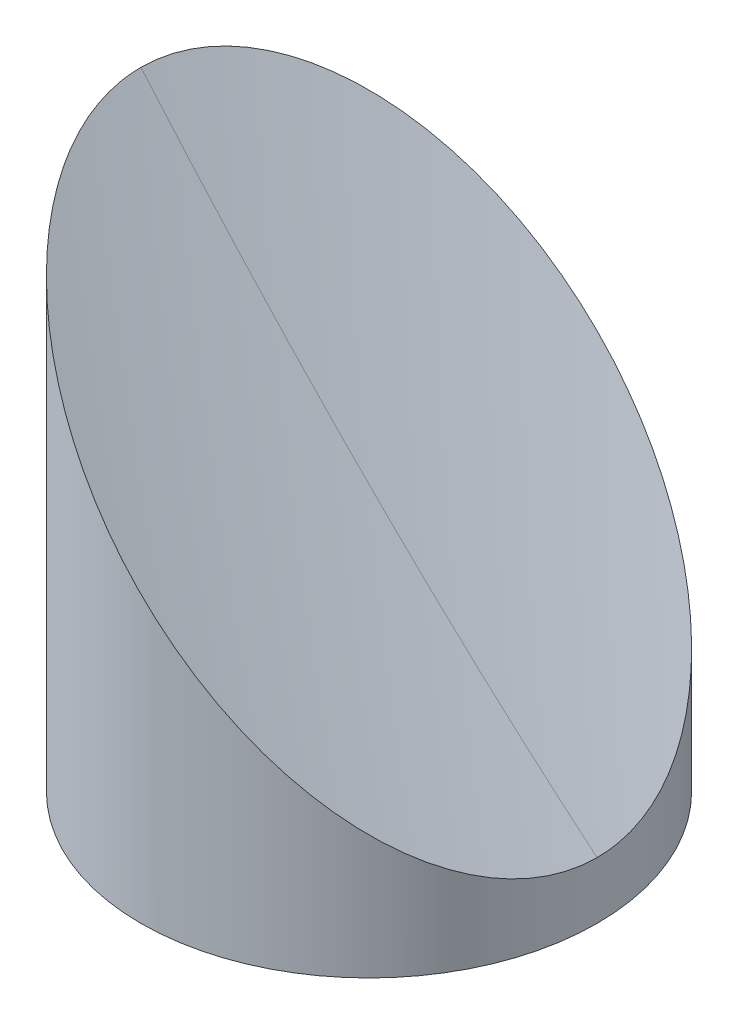
ISO-10303-21;
HEADER;
FILE_DESCRIPTION(('STEP AP214'),'2;1');
FILE_NAME('part.step','',(''),(''),'','','');
FILE_SCHEMA(('AUTOMOTIVE_DESIGN { 1 0 10303 214 1 1 1 1 }'));
ENDSEC;
DATA;
#1=APPLICATION_CONTEXT('core data for automotive mechanical design processes');
#2=APPLICATION_PROTOCOL_DEFINITION('international standard','automotive_design',2000,#1);
#3=PRODUCT_CONTEXT('',#1,'mechanical');
#4=PRODUCT('Part','Part','',(#3));
#5=PRODUCT_RELATED_PRODUCT_CATEGORY('part','',(#4));
#6=PRODUCT_DEFINITION_FORMATION('','',#4);
#7=PRODUCT_DEFINITION_CONTEXT('part definition',#1,'design');
#8=PRODUCT_DEFINITION('design','',#6,#7);
#9=PRODUCT_DEFINITION_SHAPE('','',#8);
#10=(LENGTH_UNIT() NAMED_UNIT(*) SI_UNIT(.MILLI.,.METRE.));
#11=(NAMED_UNIT(*) PLANE_ANGLE_UNIT() SI_UNIT($,.RADIAN.));
#12=(NAMED_UNIT(*) SI_UNIT($,.STERADIAN.) SOLID_ANGLE_UNIT());
#13=UNCERTAINTY_MEASURE_WITH_UNIT(LENGTH_MEASURE(1.E-05),#10,'distance_accuracy_value','');
#14=(GEOMETRIC_REPRESENTATION_CONTEXT(3) GLOBAL_UNCERTAINTY_ASSIGNED_CONTEXT((#13)) GLOBAL_UNIT_ASSIGNED_CONTEXT((#10,
#11,#12)) REPRESENTATION_CONTEXT('',''));
#15=CARTESIAN_POINT('',(0.,0.,0.));
#16=DIRECTION('',(0.,0.,1.));
#17=DIRECTION('',(1.,0.,0.));
#18=AXIS2_PLACEMENT_3D('',#15,#16,#17);
#19=CARTESIAN_POINT('',(0.,4.32,0.));
#20=DIRECTION('',(0.,1.,0.));
#21=DIRECTION('',(0.,0.,1.));
#22=AXIS2_PLACEMENT_3D('',#19,#20,#21);
#23=PLANE('',#22);
#24=CARTESIAN_POINT('',(0.,4.32,0.));
#25=DIRECTION('',(0.,-1.,0.));
#26=DIRECTION('',(0.,0.,-1.));
#27=AXIS2_PLACEMENT_3D('',#24,#25,#26);
#28=CIRCLE('',#27,2.3875);
#29=CARTESIAN_POINT('',(0.,4.32,-2.3875));
#30=VERTEX_POINT('',#29);
#31=EDGE_CURVE('E20',#30,#30,#28,.T.);
#32=ORIENTED_EDGE('',*,*,#31,.T.);
#33=EDGE_LOOP('',(#32));
#34=FACE_BOUND('',#33,.T.);
#35=ADVANCED_FACE('F17',(#34),#23,.F.);
#36=CARTESIAN_POINT('',(0.,0.,0.));
#37=DIRECTION('',(0.,-1.,0.));
#38=DIRECTION('',(0.,0.,-1.));
#39=AXIS2_PLACEMENT_3D('',#36,#37,#38);
#40=CYLINDRICAL_SURFACE('',#39,2.3875);
#41=ORIENTED_EDGE('',*,*,#31,.F.);
#42=EDGE_LOOP('',(#41));
#43=FACE_BOUND('',#42,.T.);
#44=CARTESIAN_POINT('',(0.,0.508,0.));
#45=DIRECTION('',(0.,-1.,0.));
#46=DIRECTION('',(0.,0.,-1.));
#47=AXIS2_PLACEMENT_3D('',#44,#45,#46);
#48=CIRCLE('',#47,2.3875);
#49=CARTESIAN_POINT('',(0.,0.508,-2.3875));
#50=VERTEX_POINT('',#49);
#51=EDGE_CURVE('E185',#50,#50,#48,.F.);
#52=ORIENTED_EDGE('',*,*,#51,.F.);
#53=EDGE_LOOP('',(#52));
#54=FACE_BOUND('',#53,.T.);
#55=ADVANCED_FACE('F139',(#43,#54),#40,.F.);
#56=CARTESIAN_POINT('',(0.,0.508,0.));
#57=DIRECTION('',(0.,-1.,0.));
#58=DIRECTION('',(0.,0.,-1.));
#59=AXIS2_PLACEMENT_3D('',#56,#57,#58);
#60=PLANE('',#59);
#61=ORIENTED_EDGE('',*,*,#51,.T.);
#62=EDGE_LOOP('',(#61));
#63=FACE_BOUND('',#62,.T.);
#64=CARTESIAN_POINT('',(0.,0.508,0.));
#65=DIRECTION('',(0.,-1.,0.));
#66=DIRECTION('',(0.,0.,-1.));
#67=AXIS2_PLACEMENT_3D('',#64,#65,#66);
#68=CIRCLE('',#67,12.7);
#69=CARTESIAN_POINT('',(0.,0.508,-12.7));
#70=VERTEX_POINT('',#69);
#71=EDGE_CURVE('E67',#70,#70,#68,.T.);
#72=ORIENTED_EDGE('',*,*,#71,.T.);
#73=EDGE_LOOP('',(#72));
#74=FACE_BOUND('',#73,.T.);
#75=ADVANCED_FACE('F136',(#63,#74),#60,.T.);
#76=CARTESIAN_POINT('',(7.93749999999997,5.69999999993342,13.748153285078));
#77=DIRECTION('',(0.,-1.,0.));
#78=DIRECTION('',(0.,0.,-1.));
#79=AXIS2_PLACEMENT_3D('',#76,#77,#78);
#80=CONICAL_SURFACE('',#79,1.35255000010607,1.02974425867655);
#81=CARTESIAN_POINT('',(7.93749999999997,6.5126940302207,13.748153285078));
#82=VERTEX_POINT('',#81);
#83=VERTEX_LOOP('',#82);
#84=FACE_BOUND('',#83,.T.);
#85=CARTESIAN_POINT('',(7.93749999999997,5.7,13.748153285078));
#86=DIRECTION('',(0.,-1.,0.));
#87=DIRECTION('',(0.,0.,-1.));
#88=AXIS2_PLACEMENT_3D('',#85,#86,#87);
#89=CIRCLE('',#88,1.35255);
#90=CARTESIAN_POINT('',(7.93749999999997,5.7,12.395603285078));
#91=VERTEX_POINT('',#90);
#92=EDGE_CURVE('E60',#91,#91,#89,.T.);
#93=ORIENTED_EDGE('',*,*,#92,.T.);
#94=EDGE_LOOP('',(#93));
#95=FACE_BOUND('',#94,.T.);
#96=ADVANCED_FACE('F132',(#84,#95),#80,.F.);
#97=CARTESIAN_POINT('',(7.93749999999997,5.69999999993342,-13.748153285078));
#98=DIRECTION('',(0.,-1.,0.));
#99=DIRECTION('',(0.,0.,-1.));
#100=AXIS2_PLACEMENT_3D('',#97,#98,#99);
#101=CONICAL_SURFACE('',#100,1.35255000013553,1.02974425867384);
#102=CARTESIAN_POINT('',(7.93749999999997,6.51269403027754,-13.748153285078));
#103=VERTEX_POINT('',#102);
#104=VERTEX_LOOP('',#103);
#105=FACE_BOUND('',#104,.T.);
#106=CARTESIAN_POINT('',(7.93749999999997,5.7,-13.748153285078));
#107=DIRECTION('',(0.,-1.,0.));
#108=DIRECTION('',(0.,0.,-1.));
#109=AXIS2_PLACEMENT_3D('',#106,#107,#108);
#110=CIRCLE('',#109,1.35255);
#111=CARTESIAN_POINT('',(7.93749999999997,5.7,-15.100703285078));
#112=VERTEX_POINT('',#111);
#113=EDGE_CURVE('E55',#112,#112,#110,.T.);
#114=ORIENTED_EDGE('',*,*,#113,.T.);
#115=EDGE_LOOP('',(#114));
#116=FACE_BOUND('',#115,.T.);
#117=ADVANCED_FACE('F48',(#105,#116),#101,.F.);
#118=CARTESIAN_POINT('',(-15.875,5.69999999999027,0.));
#119=DIRECTION('',(0.,-1.,0.));
#120=DIRECTION('',(0.,0.,-1.));
#121=AXIS2_PLACEMENT_3D('',#118,#119,#120);
#122=CONICAL_SURFACE('',#121,1.35255000003554,1.02974425867655);
#123=CARTESIAN_POINT('',(-15.875,6.51269403030597,-5.6843418860808E-11));
#124=VERTEX_POINT('',#123);
#125=VERTEX_LOOP('',#124);
#126=FACE_BOUND('',#125,.T.);
#127=CARTESIAN_POINT('',(-15.875,5.7,0.));
#128=DIRECTION('',(0.,-1.,0.));
#129=DIRECTION('',(0.,0.,-1.));
#130=AXIS2_PLACEMENT_3D('',#127,#128,#129);
#131=CIRCLE('',#130,1.35255);
#132=CARTESIAN_POINT('',(-15.875,5.7,-1.35255));
#133=VERTEX_POINT('',#132);
#134=EDGE_CURVE('E52',#133,#133,#131,.T.);
#135=ORIENTED_EDGE('',*,*,#134,.T.);
#136=EDGE_LOOP('',(#135));
#137=FACE_BOUND('',#136,.T.);
#138=ADVANCED_FACE('F44',(#126,#137),#122,.F.);
#139=CARTESIAN_POINT('',(15.875,4.32,0.));
#140=DIRECTION('',(0.,1.,0.));
#141=DIRECTION('',(0.,0.,1.));
#142=AXIS2_PLACEMENT_3D('',#139,#140,#141);
#143=PLANE('',#142);
#144=CARTESIAN_POINT('',(15.875,4.32,0.));
#145=DIRECTION('',(0.,-1.,0.));
#146=DIRECTION('',(0.,0.,-1.));
#147=AXIS2_PLACEMENT_3D('',#144,#145,#146);
#148=CIRCLE('',#147,2.3875);
#149=CARTESIAN_POINT('',(15.875,4.32,-2.3875));
#150=VERTEX_POINT('',#149);
#151=EDGE_CURVE('E54',#150,#150,#148,.T.);
#152=ORIENTED_EDGE('',*,*,#151,.T.);
#153=EDGE_LOOP('',(#152));
#154=FACE_BOUND('',#153,.T.);
#155=ADVANCED_FACE('F47',(#154),#143,.F.);
#156=CARTESIAN_POINT('',(0.,0.508,0.));
#157=DIRECTION('',(0.,-1.,0.));
#158=DIRECTION('',(0.,0.,-1.));
#159=AXIS2_PLACEMENT_3D('',#156,#157,#158);
#160=CYLINDRICAL_SURFACE('',#159,12.7);
#161=ORIENTED_EDGE('',*,*,#71,.F.);
#162=EDGE_LOOP('',(#161));
#163=FACE_BOUND('',#162,.T.);
#164=CARTESIAN_POINT('',(0.,0.,0.));
#165=DIRECTION('',(0.,-1.,0.));
#166=DIRECTION('',(0.,0.,-1.));
#167=AXIS2_PLACEMENT_3D('',#164,#165,#166);
#168=CIRCLE('',#167,12.7);
#169=CARTESIAN_POINT('',(0.,0.,-12.7));
#170=VERTEX_POINT('',#169);
#171=EDGE_CURVE('E178',#170,#170,#168,.T.);
#172=ORIENTED_EDGE('',*,*,#171,.T.);
#173=EDGE_LOOP('',(#172));
#174=FACE_BOUND('',#173,.T.);
#175=ADVANCED_FACE('F122',(#163,#174),#160,.F.);
#176=CARTESIAN_POINT('',(7.93749999999997,0.,13.748153285078));
#177=DIRECTION('',(0.,-1.,0.));
#178=DIRECTION('',(0.,0.,-1.));
#179=AXIS2_PLACEMENT_3D('',#176,#177,#178);
#180=CYLINDRICAL_SURFACE('',#179,1.35255);
#181=ORIENTED_EDGE('',*,*,#92,.F.);
#182=EDGE_LOOP('',(#181));
#183=FACE_BOUND('',#182,.T.);
#184=CARTESIAN_POINT('',(7.93749999999997,0.,13.748153285078));
#185=DIRECTION('',(0.,-1.,0.));
#186=DIRECTION('',(0.,0.,-1.));
#187=AXIS2_PLACEMENT_3D('',#184,#185,#186);
#188=CIRCLE('',#187,1.35255);
#189=CARTESIAN_POINT('',(7.93749999999997,0.,12.395603285078));
#190=VERTEX_POINT('',#189);
#191=EDGE_CURVE('E175',#190,#190,#188,.T.);
#192=ORIENTED_EDGE('',*,*,#191,.T.);
#193=EDGE_LOOP('',(#192));
#194=FACE_BOUND('',#193,.T.);
#195=ADVANCED_FACE('F118',(#183,#194),#180,.F.);
#196=CARTESIAN_POINT('',(7.93749999999997,0.,-13.748153285078));
#197=DIRECTION('',(0.,-1.,0.));
#198=DIRECTION('',(0.,0.,-1.));
#199=AXIS2_PLACEMENT_3D('',#196,#197,#198);
#200=CYLINDRICAL_SURFACE('',#199,1.35255);
#201=ORIENTED_EDGE('',*,*,#113,.F.);
#202=EDGE_LOOP('',(#201));
#203=FACE_BOUND('',#202,.T.);
#204=CARTESIAN_POINT('',(7.93749999999997,0.,-13.748153285078));
#205=DIRECTION('',(0.,-1.,0.));
#206=DIRECTION('',(0.,0.,-1.));
#207=AXIS2_PLACEMENT_3D('',#204,#205,#206);
#208=CIRCLE('',#207,1.35255);
#209=CARTESIAN_POINT('',(7.93749999999997,0.,-15.100703285078));
#210=VERTEX_POINT('',#209);
#211=EDGE_CURVE('E171',#210,#210,#208,.T.);
#212=ORIENTED_EDGE('',*,*,#211,.T.);
#213=EDGE_LOOP('',(#212));
#214=FACE_BOUND('',#213,.T.);
#215=ADVANCED_FACE('F115',(#203,#214),#200,.F.);
#216=CARTESIAN_POINT('',(-15.875,0.,0.));
#217=DIRECTION('',(0.,-1.,0.));
#218=DIRECTION('',(0.,0.,-1.));
#219=AXIS2_PLACEMENT_3D('',#216,#217,#218);
#220=CYLINDRICAL_SURFACE('',#219,1.35255);
#221=ORIENTED_EDGE('',*,*,#134,.F.);
#222=EDGE_LOOP('',(#221));
#223=FACE_BOUND('',#222,.T.);
#224=CARTESIAN_POINT('',(-15.875,0.,0.));
#225=DIRECTION('',(0.,-1.,0.));
#226=DIRECTION('',(0.,0.,-1.));
#227=AXIS2_PLACEMENT_3D('',#224,#225,#226);
#228=CIRCLE('',#227,1.35255);
#229=CARTESIAN_POINT('',(-15.875,0.,-1.35255));
#230=VERTEX_POINT('',#229);
#231=EDGE_CURVE('E167',#230,#230,#228,.T.);
#232=ORIENTED_EDGE('',*,*,#231,.T.);
#233=EDGE_LOOP('',(#232));
#234=FACE_BOUND('',#233,.T.);
#235=ADVANCED_FACE('F111',(#223,#234),#220,.F.);
#236=CARTESIAN_POINT('',(15.875,0.,0.));
#237=DIRECTION('',(0.,-1.,0.));
#238=DIRECTION('',(0.,0.,-1.));
#239=AXIS2_PLACEMENT_3D('',#236,#237,#238);
#240=CYLINDRICAL_SURFACE('',#239,2.3875);
#241=ORIENTED_EDGE('',*,*,#151,.F.);
#242=EDGE_LOOP('',(#241));
#243=FACE_BOUND('',#242,.T.);
#244=CARTESIAN_POINT('',(15.875,0.,0.));
#245=DIRECTION('',(0.,-1.,0.));
#246=DIRECTION('',(0.,0.,-1.));
#247=AXIS2_PLACEMENT_3D('',#244,#245,#246);
#248=CIRCLE('',#247,2.3875);
#249=CARTESIAN_POINT('',(15.875,0.,-2.3875));
#250=VERTEX_POINT('',#249);
#251=EDGE_CURVE('E163',#250,#250,#248,.T.);
#252=ORIENTED_EDGE('',*,*,#251,.T.);
#253=EDGE_LOOP('',(#252));
#254=FACE_BOUND('',#253,.T.);
#255=ADVANCED_FACE('F103',(#243,#254),#240,.F.);
#256=CARTESIAN_POINT('',(-23.074445890404,57.50590479997,30.4965345981328));
#257=CARTESIAN_POINT('',(-24.8258478094804,57.50590479997,20.4191180873354));
#258=CARTESIAN_POINT('',(-25.7047999999986,57.50590479997,10.2284765343701));
#259=CARTESIAN_POINT('',(-25.7047999999984,57.50590479997,-3.78863607153335E-12));
#260=CARTESIAN_POINT('',(2.25073084106898,27.465561866634,26.0951522516824));
#261=CARTESIAN_POINT('',(0.752098280535791,27.465561866634,17.472148962352));
#262=CARTESIAN_POINT('',(1.13122490943067E-12,27.465561866634,8.75226172364816));
#263=CARTESIAN_POINT('',(1.31752248000438E-12,27.465561866634,-3.24393290007663E-12));
#264=CARTESIAN_POINT('',(27.5759075725419,6.09630479996547,21.693769905232));
#265=CARTESIAN_POINT('',(26.330044370552,6.09630479996547,14.5251798373686));
#266=CARTESIAN_POINT('',(25.7048000000009,6.09630479996547,7.27604691292617));
#267=CARTESIAN_POINT('',(25.704800000001,6.09630479996547,-2.70269917557187E-12));
#268=(BOUNDED_SURFACE() B_SPLINE_SURFACE(2,3,((#256,#257,#258,#259),(#260,#261,#262,#263),(#264,
#265,#266,#267)),.UNSPECIFIED.,.F.,.F.,.F.) B_SPLINE_SURFACE_WITH_KNOTS((3,3),(4,4),
(0.49489920174221,0.496371537120671),(0.,1.),
.UNSPECIFIED.) GEOMETRIC_REPRESENTATION_ITEM() RATIONAL_B_SPLINE_SURFACE(((1.,0.997534009991186,
0.997534009991186,1.),(1.,0.997534009991186,0.997534009991186,1.),(1.,0.997534009991186,
0.997534009991186,1.))) REPRESENTATION_ITEM('') SURFACE());
#269=CARTESIAN_POINT('',(25.3999999999997,6.34999999996649,-5.42731465635883E-13));
#270=CARTESIAN_POINT('',(25.4000246898314,6.34997531013495,0.361855064552723));
#271=CARTESIAN_POINT('',(25.3922683330452,6.35773166692114,0.723699380888215));
#272=CARTESIAN_POINT('',(25.3613829980414,6.38861700192498,1.44583445538212));
#273=CARTESIAN_POINT('',(25.3382642129789,6.41173578698746,1.80612608433335));
#274=CARTESIAN_POINT('',(25.276849796462,6.47315020350431,2.52402792873647));
#275=CARTESIAN_POINT('',(25.2385575030126,6.51144249695372,2.88163871632561));
#276=CARTESIAN_POINT('',(25.1474782762106,6.60252172375584,3.59040931355108));
#277=CARTESIAN_POINT('',(25.0948005892528,6.65519941071364,3.94159726911459));
#278=CARTESIAN_POINT('',(24.9752577203072,6.77474227965912,4.63915216659903));
#279=CARTESIAN_POINT('',(24.908390825816,6.84160917415018,4.98551852121656));
#280=CARTESIAN_POINT('',(24.7610100157816,6.98898998418499,5.6723715156546));
#281=CARTESIAN_POINT('',(24.6804958861012,7.069504113866,6.0128580631233));
#282=CARTESIAN_POINT('',(24.4632078395029,7.28679216046431,6.85439206340667));
#283=CARTESIAN_POINT('',(24.3183387744425,7.43166122552331,7.35129801181092));
#284=CARTESIAN_POINT('',(24.0016016508626,7.74839834910449,8.32745695426674));
#285=CARTESIAN_POINT('',(23.8297345382713,7.92026546169845,8.80671056607569));
#286=CARTESIAN_POINT('',(23.4610037515401,8.28899624842319,9.74661993805747));
#287=CARTESIAN_POINT('',(23.264097184835,8.48590281511928,10.2072419543417));
#288=CARTESIAN_POINT('',(22.8478127380658,8.90218726188922,11.1078175878123));
#289=CARTESIAN_POINT('',(22.6284297457615,9.12157025420327,11.547766469576));
#290=CARTESIAN_POINT('',(22.2337018151687,9.51629818479974,12.2859837269409));
#291=CARTESIAN_POINT('',(22.0631986130446,9.68680138692138,12.5894668104846));
#292=CARTESIAN_POINT('',(21.7125707011862,10.0374292987786,13.1849783037827));
#293=CARTESIAN_POINT('',(21.5324478837108,10.2175521162552,13.4770089468697));
#294=CARTESIAN_POINT('',(20.978596288741,10.7714037112271,14.3360671780316));
#295=CARTESIAN_POINT('',(20.5914489392809,11.1585510606863,14.8859413161402));
#296=CARTESIAN_POINT('',(19.7864912721932,11.9635087277734,15.940377733468));
#297=CARTESIAN_POINT('',(19.3686315923797,12.3813684075872,16.4448640360336));
#298=CARTESIAN_POINT('',(18.5075337599777,13.2424662399895,17.4082908863656));
#299=CARTESIAN_POINT('',(18.0642951663114,13.6857048336559,17.8672306421676));
#300=CARTESIAN_POINT('',(16.9813774875435,14.7686225124239,18.9091192962485));
#301=CARTESIAN_POINT('',(16.3318518351695,15.4181481647979,19.4716524662782));
#302=CARTESIAN_POINT('',(15.0006549278296,16.7493450721378,20.5147704814825));
#303=CARTESIAN_POINT('',(14.318971380352,17.4310286196155,20.995323660029));
#304=CARTESIAN_POINT('',(12.9303609622333,18.8196390377344,21.877906763616));
#305=CARTESIAN_POINT('',(12.2234221596244,19.5265778403434,22.2798989759669));
#306=CARTESIAN_POINT('',(10.790469127797,20.9595308721709,23.0080774395678));
#307=CARTESIAN_POINT('',(10.0644567410697,21.6855432588983,23.3342709831501));
#308=CARTESIAN_POINT('',(8.57339843372094,23.1766015662472,23.9232263574772));
#309=CARTESIAN_POINT('',(7.80786057298005,23.9421394269882,24.1834890812233));
#310=CARTESIAN_POINT('',(6.26588146566822,25.4841185343002,24.6280852124803));
#311=CARTESIAN_POINT('',(5.48943998953621,26.2605600104323,24.8124170188813));
#312=CARTESIAN_POINT('',(3.9292315925388,27.8207684074299,25.1068039858385));
#313=CARTESIAN_POINT('',(3.14546168741163,28.6045383125571,25.2168274205134));
#314=CARTESIAN_POINT('',(1.57448122318953,30.1755187767794,25.3634270166204));
#315=CARTESIAN_POINT('',(0.787270402407749,30.9627295975612,25.399997490901));
#316=CARTESIAN_POINT('',(-0.977821408870538,32.7278214088397,25.4000031164014));
#317=CARTESIAN_POINT('',(-1.95573473214609,33.7057347321154,25.343594163678));
#318=CARTESIAN_POINT('',(-3.90522294718552,35.655222947155,25.1171745102248));
#319=CARTESIAN_POINT('',(-4.87679612223896,36.6267961222086,24.9471342335417));
#320=CARTESIAN_POINT('',(-6.80603218742254,38.5560321873924,24.491226608172));
#321=CARTESIAN_POINT('',(-7.76369920598122,39.5136992059511,24.2053943951657));
#322=CARTESIAN_POINT('',(-9.65705761137062,41.4070576113408,23.5141742549084));
#323=CARTESIAN_POINT('',(-10.5927583217074,42.3427583216777,23.1088380786764));
#324=CARTESIAN_POINT('',(-12.1564042085704,43.9064042085409,22.3137502760458));
#325=CARTESIAN_POINT('',(-12.7924859426696,44.5424859426401,21.9557829334388));
#326=CARTESIAN_POINT('',(-14.0450280926218,45.7950280925924,21.1764305549472));
#327=CARTESIAN_POINT('',(-14.6614892986562,46.4114892986269,20.7550480769181));
#328=CARTESIAN_POINT('',(-15.8689627493457,47.6189627493165,19.8470639192902));
#329=CARTESIAN_POINT('',(-16.4600072286152,48.210007228586,19.3605482730506));
#330=CARTESIAN_POINT('',(-17.6113398873653,49.3613398873363,18.3194637470203));
#331=CARTESIAN_POINT('',(-18.1716369757935,49.9216369757647,17.7649147319505));
#332=CARTESIAN_POINT('',(-19.113745892985,50.8637458929564,16.7384658272042));
#333=CARTESIAN_POINT('',(-19.5041895224917,51.2541895224631,16.2823789067809));
#334=CARTESIAN_POINT('',(-20.260513205823,52.010513205794,15.3310425614567));
#335=CARTESIAN_POINT('',(-20.6263944305895,52.3763944305603,14.8357950058812));
#336=CARTESIAN_POINT('',(-21.3291962601721,53.0791962601441,13.8062791220788));
#337=CARTESIAN_POINT('',(-21.6661403496054,53.4161403495789,13.2720430999113));
#338=CARTESIAN_POINT('',(-22.1463793029596,53.8963793029301,12.4418691127499));
#339=CARTESIAN_POINT('',(-22.3022537999847,54.0522537999533,12.1603596230209));
#340=CARTESIAN_POINT('',(-22.6050658550957,54.3550658550663,11.587748541671));
#341=CARTESIAN_POINT('',(-22.7520008879439,54.5020008879184,11.2966442751732));
#342=CARTESIAN_POINT('',(-23.1208559867949,54.8708559867616,10.5290086573505));
#343=CARTESIAN_POINT('',(-23.3353392170773,55.0853392170218,10.0452616047639));
#344=CARTESIAN_POINT('',(-23.7368946696313,55.4868946695753,9.05564929016863));
#345=CARTESIAN_POINT('',(-23.9239761607519,55.6739761607176,8.54979158278552));
#346=CARTESIAN_POINT('',(-24.2104501598156,55.9604501597914,7.69058992806143));
#347=CARTESIAN_POINT('',(-24.3182457372835,56.0682457372563,7.34281231383393));
#348=CARTESIAN_POINT('',(-24.5196995326482,56.2696995326189,6.63914398036643));
#349=CARTESIAN_POINT('',(-24.6133581259091,56.3633581258807,6.28325347682809));
#350=CARTESIAN_POINT('',(-24.7857626264057,56.5357626263776,5.56439898755819));
#351=CARTESIAN_POINT('',(-24.8645123903821,56.6145123903535,5.20143685804339));
#352=CARTESIAN_POINT('',(-24.9862580789698,56.7362580789412,4.57362871705267));
#353=CARTESIAN_POINT('',(-25.0330521744875,56.7830521744593,4.3102441711142));
#354=CARTESIAN_POINT('',(-25.1184570185731,56.868457018545,3.78086982289034));
#355=CARTESIAN_POINT('',(-25.157069089036,56.9070690890078,3.51488044871923));
#356=CARTESIAN_POINT('',(-25.2259282849587,56.9759282849305,2.98077776372579));
#357=CARTESIAN_POINT('',(-25.2561764141742,57.006176414146,2.71266471174182));
#358=CARTESIAN_POINT('',(-25.308249415535,57.0582494155068,2.17393341902828));
#359=CARTESIAN_POINT('',(-25.3300470946949,57.0800470946667,1.90330991371045));
#360=CARTESIAN_POINT('',(-25.3649714461871,57.1149714461589,1.36090440714117));
#361=CARTESIAN_POINT('',(-25.3780968252312,57.128096825203,1.08912223917956));
#362=CARTESIAN_POINT('',(-25.3956167451189,57.1456167450908,0.544894397213925));
#363=CARTESIAN_POINT('',(-25.4000080244384,57.1500080244105,0.272448513371786));
#364=CARTESIAN_POINT('',(-25.3999999999983,57.1499999999708,-1.81449815080106E-12));
#365=B_SPLINE_CURVE_WITH_KNOTS('',3,(#269,#270,#271,#272,#273,#274,#275,#276,#277,#278,#279,
#280,#281,#282,#283,#284,#285,#286,#287,#288,#289,#290,#291,#292,#293,#294,#295,#296,#297,#298,
#299,#300,#301,#302,#303,#304,#305,#306,#307,#308,#309,#310,#311,#312,#313,#314,#315,#316,#317,
#318,#319,#320,#321,#322,#323,#324,#325,#326,#327,#328,#329,#330,#331,#332,#333,#334,#335,#336,
#337,#338,#339,#340,#341,#342,#343,#344,#345,#346,#347,#348,#349,#350,#351,#352,#353,#354,#355,
#356,#357,#358,#359,#360,#361,#362,#363,#364),.UNSPECIFIED.,.F.,.F.,(4,2,2,2,2,2,2,2,2,2,2,2,2,
2,2,2,2,2,2,2,2,2,2,2,2,2,2,2,2,2,2,2,2,2,2,2,2,2,2,2,2,2,2,2,2,2,2,4),(0.,1.08538175892369,
2.1700440721846,3.25446790401943,4.33087497918706,5.40741204048895,6.48396599518012,
8.09457924491911,9.70513607632468,11.3184899228286,12.9322115431315,14.0946492746417,
15.2568591811486,17.5817291460253,19.9104210882286,22.2391535146893,25.4657956650714,
28.6936813707351,31.9231128164959,35.1522334408757,38.489835189769,41.8275073130781,
45.1666035526817,48.5059583143925,52.6535708346186,56.8022633158385,60.9496978676874,
65.0953390104634,67.9976631929157,70.8998703412098,73.7982811524543,76.695847676555,
78.8426699444136,80.9893897959125,83.1343506294145,84.2066969853876,85.279344866718,
86.9905859791621,88.7012469076901,89.8398607414458,90.9784443375025,92.1167329915581,
92.9312073417724,93.7455500043056,94.5597948952074,95.3766386436278,96.1936041793482,
97.0108747325237),.UNSPECIFIED.);
#366=CARTESIAN_POINT('',(25.4,6.34999999996649,-2.71365732817942E-13));
#367=VERTEX_POINT('',#366);
#368=CARTESIAN_POINT('',(-25.4000000000008,57.1499999999731,-1.13077958953607E-12));
#369=VERTEX_POINT('',#368);
#370=EDGE_CURVE('E76',#367,#369,#365,.T.);
#371=CARTESIAN_POINT('',(-25.704799999998,57.50590479997,0.));
#372=CARTESIAN_POINT('',(1.72431513512095E-12,27.465561866634,0.));
#373=CARTESIAN_POINT('',(25.7048000000014,6.09630479996547,0.));
#374=B_SPLINE_CURVE_WITH_KNOTS('',2,(#371,#372,#373),.UNSPECIFIED.,.F.,.F.,(3,3),
(0.49489920174221,0.496371537120671),.UNSPECIFIED.);
#375=EDGE_CURVE('E32',#369,#367,#374,.T.);
#376=ORIENTED_EDGE('',*,*,#370,.F.);
#377=ORIENTED_EDGE('',*,*,#375,.F.);
#378=EDGE_LOOP('',(#376,#377));
#379=FACE_BOUND('',#378,.T.);
#380=ADVANCED_FACE('F91',(#379),#268,.T.);
#381=CARTESIAN_POINT('',(-25.704799999998,57.50590479997,0.));
#382=CARTESIAN_POINT('',(-25.704799999998,57.50590479997,-10.1652998162135));
#383=CARTESIAN_POINT('',(-24.8366457171023,57.50590479997,-20.2934599894434));
#384=CARTESIAN_POINT('',(-23.1066808776554,57.50590479997,-30.3104726183557));
#385=CARTESIAN_POINT('',(-23.0806479768223,57.50590479997,-30.4612108822019));
#386=CARTESIAN_POINT('',(-23.0546150759891,57.50590479997,-30.6119491460481));
#387=CARTESIAN_POINT('',(-23.0285821751559,57.50590479997,-30.7626874098943));
#388=CARTESIAN_POINT('',(1.72431513512095E-12,27.465561866634,0.));
#389=CARTESIAN_POINT('',(1.72431513512095E-12,27.465561866634,-8.69820292317186));
#390=CARTESIAN_POINT('',(0.742858770306036,27.465561866634,-17.3646263457873));
#391=CARTESIAN_POINT('',(2.22314813663252,27.465561866634,-25.9359434840465));
#392=CARTESIAN_POINT('',(2.24542386467004,27.465561866634,-26.0649265962937));
#393=CARTESIAN_POINT('',(2.26769959270756,27.465561866634,-26.1939097085409));
#394=CARTESIAN_POINT('',(2.28997532074508,27.465561866634,-26.322892820788));
#395=CARTESIAN_POINT('',(25.7048000000014,6.09630479996547,0.));
#396=CARTESIAN_POINT('',(25.7048000000014,6.09630479996547,-7.23110603013021));
#397=CARTESIAN_POINT('',(26.3223632577144,6.09630479996547,-14.4357927021312));
#398=CARTESIAN_POINT('',(27.5529771509205,6.09630479996547,-21.5614143497374));
#399=CARTESIAN_POINT('',(27.5714957061624,6.09630479996547,-21.6686423103855));
#400=CARTESIAN_POINT('',(27.5900142614042,6.09630479996547,-21.7758702710337));
#401=CARTESIAN_POINT('',(27.6085328166461,6.09630479996547,-21.8830982316818));
#402=(BOUNDED_SURFACE() B_SPLINE_SURFACE(2,3,((#381,#382,#383,#384,#385,#386,#387),(#388,#389,
#390,#391,#392,#393,#394),(#395,#396,#397,#398,#399,#400,#401)),.UNSPECIFIED.,.F.,.F.,
.F.) B_SPLINE_SURFACE_WITH_KNOTS((3,3),(4,3,4),(0.49489920174221,0.496371537120671),(0.,1.,
1.01508496806346),.UNSPECIFIED.) GEOMETRIC_REPRESENTATION_ITEM() RATIONAL_B_SPLINE_SURFACE(((1.,
0.997564286106979,0.997564286106979,1.,1.,1.,1.),(1.,0.997564286106979,0.997564286106979,1.,1.,
1.,1.),(1.,0.997564286106979,0.997564286106979,1.,1.,1.,1.))) REPRESENTATION_ITEM('') SURFACE());
#403=CARTESIAN_POINT('',(-25.400000000001,57.1499999999731,-2.26155917907214E-12));
#404=CARTESIAN_POINT('',(-25.4000298842022,57.1500298841744,-0.379798285888441));
#405=CARTESIAN_POINT('',(-25.3914826589738,57.141482658946,-0.759582908821394));
#406=CARTESIAN_POINT('',(-25.3574646705599,57.1074646705322,-1.51733291794756));
#407=CARTESIAN_POINT('',(-25.3320073369776,57.0820073369499,-1.89529950824583));
#408=CARTESIAN_POINT('',(-25.2644080371409,57.0144080371132,-2.64812994982801));
#409=CARTESIAN_POINT('',(-25.2222704537159,56.9722704536882,-3.02299458977304));
#410=CARTESIAN_POINT('',(-25.1221538202047,56.872153820177,-3.76515354126528));
#411=CARTESIAN_POINT('',(-25.0643125384711,56.8143125384433,-4.13248512179427));
#412=CARTESIAN_POINT('',(-24.9331464539619,56.6831464539342,-4.86162930388514));
#413=CARTESIAN_POINT('',(-24.8598194239318,56.6098194239041,-5.22344110352361));
#414=CARTESIAN_POINT('',(-24.6983254001991,56.4483254001714,-5.94035222994182));
#415=CARTESIAN_POINT('',(-24.6101581320423,56.3601581320146,-6.2954514324442));
#416=CARTESIAN_POINT('',(-24.3724820826906,56.1224820826628,-7.17204086328409));
#417=CARTESIAN_POINT('',(-24.2142206113129,55.964220611285,-7.68882815921594));
#418=CARTESIAN_POINT('',(-23.8686825985231,55.6186825984952,-8.70246278757979));
#419=CARTESIAN_POINT('',(-23.681407060755,55.4314070607272,-9.19931080899566));
#420=CARTESIAN_POINT('',(-23.2801060379158,55.0301060378879,-10.1722221333257));
#421=CARTESIAN_POINT('',(-23.0660267832244,54.8160267831963,-10.6482409860836));
#422=CARTESIAN_POINT('',(-22.6140933072559,54.364093307228,-11.5771190459063));
#423=CARTESIAN_POINT('',(-22.3762358602155,54.1262358601878,-12.0299750980609));
#424=CARTESIAN_POINT('',(-21.7778695261766,53.5278695261489,-13.0916798500904));
#425=CARTESIAN_POINT('',(-21.4069114917312,53.1569114917032,-13.6887954840134));
#426=CARTESIAN_POINT('',(-20.6293851356636,52.3793851356353,-14.8346994998167));
#427=CARTESIAN_POINT('',(-20.2228045940402,51.9728045940119,-15.3834711672175));
#428=CARTESIAN_POINT('',(-19.3790976455395,51.1290976455112,-16.4336522098639));
#429=CARTESIAN_POINT('',(-18.9419244580471,50.6919244580188,-16.934986165761));
#430=CARTESIAN_POINT('',(-18.0425038931179,49.7925038930893,-17.8901780052835));
#431=CARTESIAN_POINT('',(-17.5802560698251,49.3302560697962,-18.3440350442941));
#432=CARTESIAN_POINT('',(-16.4519988928132,48.2019988927841,-19.3720991149074));
#433=CARTESIAN_POINT('',(-15.7762732426972,47.5262732426684,-19.9250443757076));
#434=CARTESIAN_POINT('',(-14.3933785929815,46.1433785929527,-20.9458757061852));
#435=CARTESIAN_POINT('',(-13.6861972910908,45.4361972910619,-21.4137281255127));
#436=CARTESIAN_POINT('',(-12.2475198632585,43.9975198632293,-22.2678734311949));
#437=CARTESIAN_POINT('',(-11.5160175819661,43.2660175819369,-22.6541454858443));
#438=CARTESIAN_POINT('',(-10.0348005508446,41.7848005508152,-23.3480526987948));
#439=CARTESIAN_POINT('',(-9.28508842398071,41.0350884239512,-23.6556991097203));
#440=CARTESIAN_POINT('',(-7.83265768162075,39.5826576815911,-24.1734436358283));
#441=CARTESIAN_POINT('',(-7.13097013930405,38.8809701392743,-24.3893716327427));
#442=CARTESIAN_POINT('',(-5.71945222010757,37.4694522200777,-24.7584324401475));
#443=CARTESIAN_POINT('',(-5.00962233497996,36.75962233495,-24.911569022577));
#444=CARTESIAN_POINT('',(-3.58449444106441,35.3344944410343,-25.1561966242659));
#445=CARTESIAN_POINT('',(-2.8691950445628,34.6191950445326,-25.2476714359557));
#446=CARTESIAN_POINT('',(-1.43595315751401,33.1859531574837,-25.3695756145012));
#447=CARTESIAN_POINT('',(-0.718010340917254,32.4680103408868,-25.3999971796198));
#448=CARTESIAN_POINT('',(0.977618025646537,30.7723819743229,-25.4000038401321));
#449=CARTESIAN_POINT('',(1.95536123194857,29.7946387680207,-25.3436155771611));
#450=CARTESIAN_POINT('',(3.90453880374345,27.8454611962256,-25.1172759299378));
#451=CARTESIAN_POINT('',(4.87597115184438,26.8740288481246,-24.9472898773383));
#452=CARTESIAN_POINT('',(6.80524064512294,24.9447593548458,-24.4914529359307));
#453=CARTESIAN_POINT('',(7.76307763386995,23.9869223660987,-24.2056007150626));
#454=CARTESIAN_POINT('',(9.65675803371385,22.0932419662546,-23.5143042047831));
#455=CARTESIAN_POINT('',(10.5926110132571,21.1573889867113,-23.1089130259479));
#456=CARTESIAN_POINT('',(12.1564250124348,19.5935749875334,-22.3137396672593));
#457=CARTESIAN_POINT('',(12.7925271191726,18.9574728807955,-21.9557597539118));
#458=CARTESIAN_POINT('',(14.0451100137317,17.7048899862362,-21.1763771410361));
#459=CARTESIAN_POINT('',(14.6615915468029,17.088408453165,-20.7549768539002));
#460=CARTESIAN_POINT('',(15.8690625367928,15.8809374631749,-19.8469832235585));
#461=CARTESIAN_POINT('',(16.4600859019156,15.2899140980521,-19.3604803792341));
#462=CARTESIAN_POINT('',(17.6113778154825,14.1386221844849,-18.3194262061683));
#463=CARTESIAN_POINT('',(18.1716552893948,13.5783447105724,-17.7648947788519));
#464=CARTESIAN_POINT('',(19.1137433424708,12.6362566574965,-16.7384686060608));
#465=CARTESIAN_POINT('',(19.5041845582456,12.2458154417219,-16.2823847052699));
#466=CARTESIAN_POINT('',(20.2605038046281,11.489496195339,-15.3310548324203));
#467=CARTESIAN_POINT('',(20.6263830024232,11.1236169975432,-14.8358107236946));
#468=CARTESIAN_POINT('',(21.329185587102,10.4208144128659,-13.8062957784369));
#469=CARTESIAN_POINT('',(21.6661321004239,10.083867899546,-13.2720567553192));
#470=CARTESIAN_POINT('',(22.1463743894219,9.6036256105438,-12.4418779090132));
#471=CARTESIAN_POINT('',(22.3022499460742,9.44775005388887,-12.1603667445376));
#472=CARTESIAN_POINT('',(22.605064012415,9.14493598755102,-11.5877521923206));
#473=CARTESIAN_POINT('',(22.7519999968363,8.99800000313532,-11.2966461296691));
#474=CARTESIAN_POINT('',(23.1208562473998,8.62914375256199,-10.5290081150299));
#475=CARTESIAN_POINT('',(23.3353397098539,8.41466029007798,-10.0452604933594));
#476=CARTESIAN_POINT('',(23.7368955602508,8.01310443967966,-9.05564699233511));
#477=CARTESIAN_POINT('',(23.9239772171509,7.82602278280811,-8.54978866769373));
#478=CARTESIAN_POINT('',(24.2104511665996,7.53954883337243,-7.6905867398106));
#479=CARTESIAN_POINT('',(24.3182465804557,7.43175341951241,-7.34280950088361));
#480=CARTESIAN_POINT('',(24.5197000791938,7.23029992077164,-6.63914193913373));
#481=CARTESIAN_POINT('',(24.6133585394603,7.13664146050633,-6.28325183202424));
#482=CARTESIAN_POINT('',(24.7857628074823,6.9642371924846,-5.56439815304455));
#483=CARTESIAN_POINT('',(24.8645124719594,6.88548752800647,-5.20143643738154));
#484=CARTESIAN_POINT('',(24.9862580607216,6.76374193924436,-4.57362881112711));
#485=CARTESIAN_POINT('',(25.0330521408704,6.71694785909613,-4.31024436032714));
#486=CARTESIAN_POINT('',(25.1184569601954,6.63154303977153,-3.78087020389301));
#487=CARTESIAN_POINT('',(25.1570690212588,6.592930978708,-3.51488092637058));
#488=CARTESIAN_POINT('',(25.2259282045189,6.5240717954477,-2.98077843570568));
#489=CARTESIAN_POINT('',(25.2561763304658,6.4938236695009,-2.71266548140015));
#490=CARTESIAN_POINT('',(25.3082493501551,6.44175064981159,-2.17393419210618));
#491=CARTESIAN_POINT('',(25.3300470448142,6.41995295515252,-1.90331059134684));
#492=CARTESIAN_POINT('',(25.3649714211736,6.38502857879306,-1.36090489265125));
#493=CARTESIAN_POINT('',(25.3780968095833,6.3719031903833,-1.08912262800445));
#494=CARTESIAN_POINT('',(25.3956167419855,6.35438325798118,-0.544894591978381));
#495=CARTESIAN_POINT('',(25.4000080244499,6.3499919755169,-0.272448610760665));
#496=CARTESIAN_POINT('',(25.4000000000005,6.34999999996648,-4.32553925929646E-13));
#497=B_SPLINE_CURVE_WITH_KNOTS('',3,(#403,#404,#405,#406,#407,#408,#409,#410,#411,#412,#413,
#414,#415,#416,#417,#418,#419,#420,#421,#422,#423,#424,#425,#426,#427,#428,#429,#430,#431,#432,
#433,#434,#435,#436,#437,#438,#439,#440,#441,#442,#443,#444,#445,#446,#447,#448,#449,#450,#451,
#452,#453,#454,#455,#456,#457,#458,#459,#460,#461,#462,#463,#464,#465,#466,#467,#468,#469,#470,
#471,#472,#473,#474,#475,#476,#477,#478,#479,#480,#481,#482,#483,#484,#485,#486,#487,#488,#489,
#490,#491,#492,#493,#494,#495,#496),.UNSPECIFIED.,.F.,.F.,(4,2,2,2,2,2,2,2,2,2,2,2,2,2,2,2,2,2,
2,2,2,2,2,2,2,2,2,2,2,2,2,2,2,2,2,2,2,2,2,2,2,2,2,2,2,2,4),(0.,1.13918067104204,
2.27745771201551,3.41543586261699,4.54373628871203,5.67219910450208,6.80068279228819,
8.48812106349536,10.1755009764849,11.8663217869631,13.5573722872537,15.9383225775075,
18.3200928547921,20.7055883360698,23.0911262481223,26.3984556914312,29.7070902028534,
33.0165685617842,36.3255730142966,39.3702023264081,42.4146487179779,45.4598950193781,
48.5055304352018,52.6523621901089,56.8004600743685,60.9486056487516,65.0949109920861,
67.9973291022215,70.8996368377024,73.7979512003852,76.6954196884835,78.8422283159549,
80.9889348547302,83.133909199808,84.2062622783186,85.278916883978,86.9901599613624,
88.7008228487886,89.8394353748351,90.9780176614969,92.116305007288,92.9307790650124,
93.7451214357981,94.5593660354644,95.3762100754861,96.1931759030023,97.0104467482415),.UNSPECIFIED.);
#498=EDGE_CURVE('E26',#369,#367,#497,.T.);
#499=ORIENTED_EDGE('',*,*,#375,.T.);
#500=ORIENTED_EDGE('',*,*,#498,.F.);
#501=EDGE_LOOP('',(#499,#500));
#502=FACE_BOUND('',#501,.T.);
#503=ADVANCED_FACE('F85',(#502),#402,.T.);
#504=CARTESIAN_POINT('',(0.,0.,0.));
#505=DIRECTION('',(0.,1.,0.));
#506=DIRECTION('',(0.,0.,1.));
#507=AXIS2_PLACEMENT_3D('',#504,#505,#506);
#508=PLANE('',#507);
#509=CARTESIAN_POINT('',(0.,0.,0.));
#510=DIRECTION('',(0.,-1.,0.));
#511=DIRECTION('',(0.,0.,-1.));
#512=AXIS2_PLACEMENT_3D('',#509,#510,#511);
#513=CIRCLE('',#512,25.4);
#514=CARTESIAN_POINT('',(0.,0.,-25.4));
#515=VERTEX_POINT('',#514);
#516=EDGE_CURVE('E10',#515,#515,#513,.F.);
#517=ORIENTED_EDGE('',*,*,#516,.F.);
#518=EDGE_LOOP('',(#517));
#519=FACE_BOUND('',#518,.T.);
#520=ORIENTED_EDGE('',*,*,#251,.F.);
#521=EDGE_LOOP('',(#520));
#522=FACE_BOUND('',#521,.T.);
#523=ORIENTED_EDGE('',*,*,#231,.F.);
#524=EDGE_LOOP('',(#523));
#525=FACE_BOUND('',#524,.T.);
#526=ORIENTED_EDGE('',*,*,#211,.F.);
#527=EDGE_LOOP('',(#526));
#528=FACE_BOUND('',#527,.T.);
#529=ORIENTED_EDGE('',*,*,#191,.F.);
#530=EDGE_LOOP('',(#529));
#531=FACE_BOUND('',#530,.T.);
#532=ORIENTED_EDGE('',*,*,#171,.F.);
#533=EDGE_LOOP('',(#532));
#534=FACE_BOUND('',#533,.T.);
#535=ADVANCED_FACE('F90',(#519,#522,#525,#528,#531,#534),#508,.F.);
#536=CARTESIAN_POINT('',(0.,90.2363292090008,0.));
#537=DIRECTION('',(0.,-1.,0.));
#538=DIRECTION('',(0.,0.,-1.));
#539=AXIS2_PLACEMENT_3D('',#536,#537,#538);
#540=CYLINDRICAL_SURFACE('',#539,25.4);
#541=ORIENTED_EDGE('',*,*,#498,.T.);
#542=ORIENTED_EDGE('',*,*,#370,.T.);
#543=EDGE_LOOP('',(#541,#542));
#544=FACE_BOUND('',#543,.T.);
#545=ORIENTED_EDGE('',*,*,#516,.T.);
#546=EDGE_LOOP('',(#545));
#547=FACE_BOUND('',#546,.T.);
#548=ADVANCED_FACE('F82',(#544,#547),#540,.T.);
#549=CLOSED_SHELL('',(#35,#55,#75,#96,#117,#138,#155,#175,#195,#215,#235,#255,#380,#503,#535,#548));
#550=MANIFOLD_SOLID_BREP('B1',#549);
#551=ADVANCED_BREP_SHAPE_REPRESENTATION('',(#18,#550),#14);
#552=SHAPE_DEFINITION_REPRESENTATION(#9,#551);
ENDSEC;
END-ISO-10303-21;
